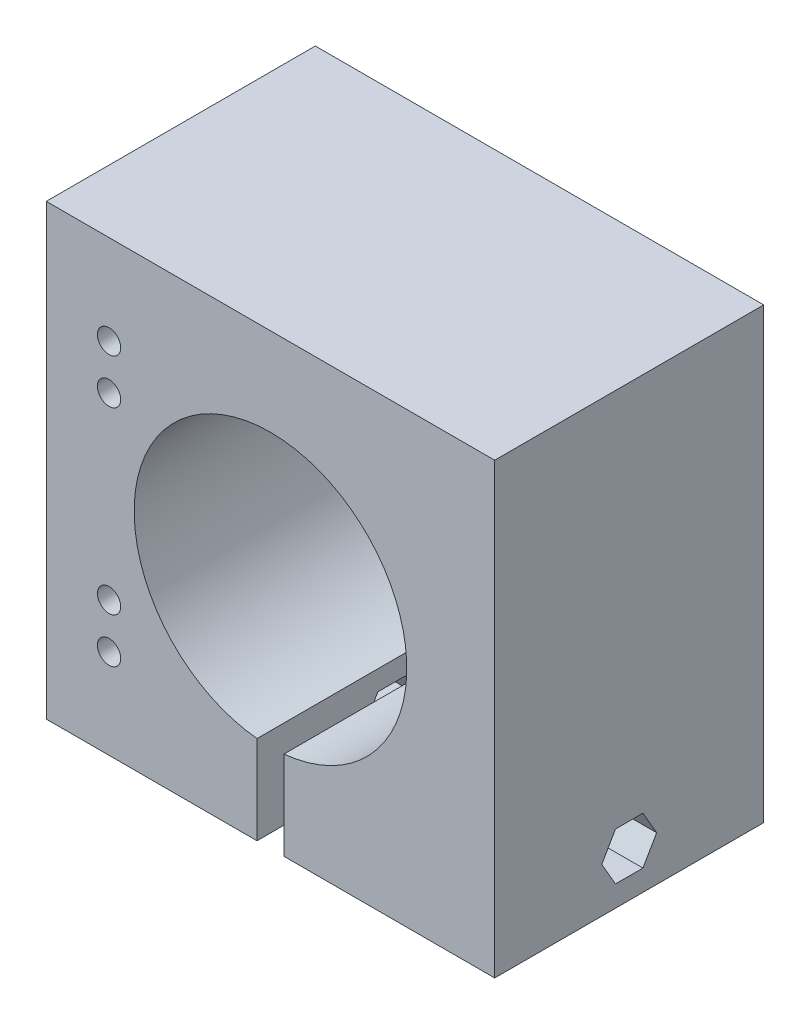
ISO-10303-21;
HEADER;
FILE_DESCRIPTION(('STEP AP214'),'2;1');
FILE_NAME('part.step','',(''),(''),'','','');
FILE_SCHEMA(('AUTOMOTIVE_DESIGN { 1 0 10303 214 1 1 1 1 }'));
ENDSEC;
DATA;
#1=APPLICATION_CONTEXT('core data for automotive mechanical design processes');
#2=APPLICATION_PROTOCOL_DEFINITION('international standard','automotive_design',2000,#1);
#3=PRODUCT_CONTEXT('',#1,'mechanical');
#4=PRODUCT('Part','Part','',(#3));
#5=PRODUCT_RELATED_PRODUCT_CATEGORY('part','',(#4));
#6=PRODUCT_DEFINITION_FORMATION('','',#4);
#7=PRODUCT_DEFINITION_CONTEXT('part definition',#1,'design');
#8=PRODUCT_DEFINITION('design','',#6,#7);
#9=PRODUCT_DEFINITION_SHAPE('','',#8);
#10=(LENGTH_UNIT() NAMED_UNIT(*) SI_UNIT(.MILLI.,.METRE.));
#11=(NAMED_UNIT(*) PLANE_ANGLE_UNIT() SI_UNIT($,.RADIAN.));
#12=(NAMED_UNIT(*) SI_UNIT($,.STERADIAN.) SOLID_ANGLE_UNIT());
#13=UNCERTAINTY_MEASURE_WITH_UNIT(LENGTH_MEASURE(1.E-05),#10,'distance_accuracy_value','');
#14=(GEOMETRIC_REPRESENTATION_CONTEXT(3) GLOBAL_UNCERTAINTY_ASSIGNED_CONTEXT((#13)) GLOBAL_UNIT_ASSIGNED_CONTEXT((#10,
#11,#12)) REPRESENTATION_CONTEXT('',''));
#15=CARTESIAN_POINT('',(0.,0.,0.));
#16=DIRECTION('',(0.,0.,1.));
#17=DIRECTION('',(1.,0.,0.));
#18=AXIS2_PLACEMENT_3D('',#15,#16,#17);
#19=CARTESIAN_POINT('',(-4.,5.,11.940043573295));
#20=DIRECTION('',(0.,0.5,-0.866025403784439));
#21=DIRECTION('',(0.,0.866025403784439,0.5));
#22=AXIS2_PLACEMENT_3D('',#19,#20,#21);
#23=PLANE('',#22);
#24=DIRECTION('',(0.,0.866025403784439,0.5));
#25=VECTOR('',#24,1.);
#26=CARTESIAN_POINT('',(5.,5.,11.940043573295));
#27=LINE('',#26,#25);
#28=CARTESIAN_POINT('',(5.,5.,11.940043573295));
#29=VERTEX_POINT('',#28);
#30=CARTESIAN_POINT('',(5.,7.65,13.4700217866475));
#31=VERTEX_POINT('',#30);
#32=EDGE_CURVE('E265',#29,#31,#27,.T.);
#33=ORIENTED_EDGE('',*,*,#32,.F.);
#34=DIRECTION('',(1.,0.,0.));
#35=VECTOR('',#34,1.);
#36=CARTESIAN_POINT('',(-4.,5.,11.940043573295));
#37=LINE('',#36,#35);
#38=CARTESIAN_POINT('',(23.5,5.,11.940043573295));
#39=VERTEX_POINT('',#38);
#40=EDGE_CURVE('E300',#29,#39,#37,.T.);
#41=ORIENTED_EDGE('',*,*,#40,.T.);
#42=DIRECTION('',(0.,-0.866025403784439,-0.5));
#43=VECTOR('',#42,1.);
#44=CARTESIAN_POINT('',(23.5,-3.92062354108518,6.78971917051014));
#45=LINE('',#44,#43);
#46=CARTESIAN_POINT('',(23.5,7.65,13.4700217866475));
#47=VERTEX_POINT('',#46);
#48=EDGE_CURVE('E406',#47,#39,#45,.T.);
#49=ORIENTED_EDGE('',*,*,#48,.F.);
#50=DIRECTION('',(1.,0.,0.));
#51=VECTOR('',#50,1.);
#52=CARTESIAN_POINT('',(-4.,7.65,13.4700217866475));
#53=LINE('',#52,#51);
#54=EDGE_CURVE('E297',#31,#47,#53,.T.);
#55=ORIENTED_EDGE('',*,*,#54,.F.);
#56=EDGE_LOOP('',(#33,#41,#49,#55));
#57=FACE_BOUND('',#56,.T.);
#58=ADVANCED_FACE('F32',(#57),#23,.F.);
#59=CARTESIAN_POINT('',(-4.,7.65,13.4700217866475));
#60=DIRECTION('',(0.,1.,0.));
#61=DIRECTION('',(0.,0.,1.));
#62=AXIS2_PLACEMENT_3D('',#59,#60,#61);
#63=PLANE('',#62);
#64=DIRECTION('',(0.,0.,1.));
#65=VECTOR('',#64,1.);
#66=CARTESIAN_POINT('',(5.,7.65,13.4700217866475));
#67=LINE('',#66,#65);
#68=CARTESIAN_POINT('',(5.,7.65,16.5299782133525));
#69=VERTEX_POINT('',#68);
#70=EDGE_CURVE('E263',#31,#69,#67,.T.);
#71=ORIENTED_EDGE('',*,*,#70,.F.);
#72=ORIENTED_EDGE('',*,*,#54,.T.);
#73=DIRECTION('',(0.,0.,-1.));
#74=VECTOR('',#73,1.);
#75=CARTESIAN_POINT('',(23.5,7.65,-0.001000000000001));
#76=LINE('',#75,#74);
#77=CARTESIAN_POINT('',(23.5,7.65,16.5299782133525));
#78=VERTEX_POINT('',#77);
#79=EDGE_CURVE('E409',#78,#47,#76,.T.);
#80=ORIENTED_EDGE('',*,*,#79,.F.);
#81=DIRECTION('',(1.,0.,0.));
#82=VECTOR('',#81,1.);
#83=CARTESIAN_POINT('',(-4.,7.65,16.5299782133525));
#84=LINE('',#83,#82);
#85=EDGE_CURVE('E294',#69,#78,#84,.T.);
#86=ORIENTED_EDGE('',*,*,#85,.F.);
#87=EDGE_LOOP('',(#71,#72,#80,#86));
#88=FACE_BOUND('',#87,.T.);
#89=ADVANCED_FACE('F447',(#88),#63,.F.);
#90=CARTESIAN_POINT('',(-4.,7.65,16.5299782133525));
#91=DIRECTION('',(0.,0.5,0.866025403784438));
#92=DIRECTION('',(0.,-0.866025403784438,0.5));
#93=AXIS2_PLACEMENT_3D('',#90,#91,#92);
#94=PLANE('',#93);
#95=DIRECTION('',(0.,-0.866025403784438,0.5));
#96=VECTOR('',#95,1.);
#97=CARTESIAN_POINT('',(5.,7.65,16.5299782133525));
#98=LINE('',#97,#96);
#99=CARTESIAN_POINT('',(5.,5.,18.059956426705));
#100=VERTEX_POINT('',#99);
#101=EDGE_CURVE('E261',#69,#100,#98,.T.);
#102=ORIENTED_EDGE('',*,*,#101,.F.);
#103=ORIENTED_EDGE('',*,*,#85,.T.);
#104=DIRECTION('',(0.,0.866025403784438,-0.5));
#105=VECTOR('',#104,1.);
#106=CARTESIAN_POINT('',(23.5,9.07062354108519,15.7097808294899));
#107=LINE('',#106,#105);
#108=CARTESIAN_POINT('',(23.5,5.,18.059956426705));
#109=VERTEX_POINT('',#108);
#110=EDGE_CURVE('E412',#109,#78,#107,.T.);
#111=ORIENTED_EDGE('',*,*,#110,.F.);
#112=DIRECTION('',(1.,0.,0.));
#113=VECTOR('',#112,1.);
#114=CARTESIAN_POINT('',(-4.,5.,18.059956426705));
#115=LINE('',#114,#113);
#116=EDGE_CURVE('E291',#100,#109,#115,.T.);
#117=ORIENTED_EDGE('',*,*,#116,.F.);
#118=EDGE_LOOP('',(#102,#103,#111,#117));
#119=FACE_BOUND('',#118,.T.);
#120=ADVANCED_FACE('F443',(#119),#94,.F.);
#121=CARTESIAN_POINT('',(-4.,5.,18.059956426705));
#122=DIRECTION('',(0.,-0.499999999999999,0.866025403784439));
#123=DIRECTION('',(0.,-0.866025403784439,-0.499999999999999));
#124=AXIS2_PLACEMENT_3D('',#121,#122,#123);
#125=PLANE('',#124);
#126=DIRECTION('',(0.,-0.866025403784439,-0.499999999999999));
#127=VECTOR('',#126,1.);
#128=CARTESIAN_POINT('',(5.,5.,18.059956426705));
#129=LINE('',#128,#127);
#130=CARTESIAN_POINT('',(5.,2.35,16.5299782133525));
#131=VERTEX_POINT('',#130);
#132=EDGE_CURVE('E259',#100,#131,#129,.T.);
#133=ORIENTED_EDGE('',*,*,#132,.F.);
#134=ORIENTED_EDGE('',*,*,#116,.T.);
#135=DIRECTION('',(0.,0.866025403784439,0.499999999999999));
#136=VECTOR('',#135,1.);
#137=CARTESIAN_POINT('',(23.5,-6.57062354108518,11.3796538105677));
#138=LINE('',#137,#136);
#139=CARTESIAN_POINT('',(23.5,2.35,16.5299782133525));
#140=VERTEX_POINT('',#139);
#141=EDGE_CURVE('E415',#140,#109,#138,.T.);
#142=ORIENTED_EDGE('',*,*,#141,.F.);
#143=DIRECTION('',(1.,0.,0.));
#144=VECTOR('',#143,1.);
#145=CARTESIAN_POINT('',(-4.,2.35,16.5299782133525));
#146=LINE('',#145,#144);
#147=EDGE_CURVE('E288',#131,#140,#146,.T.);
#148=ORIENTED_EDGE('',*,*,#147,.F.);
#149=EDGE_LOOP('',(#133,#134,#142,#148));
#150=FACE_BOUND('',#149,.T.);
#151=ADVANCED_FACE('F437',(#150),#125,.F.);
#152=CARTESIAN_POINT('',(-4.,2.35,16.5299782133525));
#153=DIRECTION('',(0.,-1.,0.));
#154=DIRECTION('',(0.,0.,-1.));
#155=AXIS2_PLACEMENT_3D('',#152,#153,#154);
#156=PLANE('',#155);
#157=DIRECTION('',(0.,0.,-1.));
#158=VECTOR('',#157,1.);
#159=CARTESIAN_POINT('',(5.,2.35,16.5299782133525));
#160=LINE('',#159,#158);
#161=CARTESIAN_POINT('',(5.,2.35,13.4700217866475));
#162=VERTEX_POINT('',#161);
#163=EDGE_CURVE('E54',#131,#162,#160,.T.);
#164=ORIENTED_EDGE('',*,*,#163,.F.);
#165=ORIENTED_EDGE('',*,*,#147,.T.);
#166=DIRECTION('',(0.,0.,1.));
#167=VECTOR('',#166,1.);
#168=CARTESIAN_POINT('',(23.5,2.35,-0.001000000000001));
#169=LINE('',#168,#167);
#170=CARTESIAN_POINT('',(23.5,2.35,13.4700217866475));
#171=VERTEX_POINT('',#170);
#172=EDGE_CURVE('E418',#171,#140,#169,.T.);
#173=ORIENTED_EDGE('',*,*,#172,.F.);
#174=DIRECTION('',(1.,0.,0.));
#175=VECTOR('',#174,1.);
#176=CARTESIAN_POINT('',(-4.,2.35,13.4700217866475));
#177=LINE('',#176,#175);
#178=EDGE_CURVE('E287',#162,#171,#177,.T.);
#179=ORIENTED_EDGE('',*,*,#178,.F.);
#180=EDGE_LOOP('',(#164,#165,#173,#179));
#181=FACE_BOUND('',#180,.T.);
#182=ADVANCED_FACE('F432',(#181),#156,.F.);
#183=CARTESIAN_POINT('',(-4.,2.35,13.4700217866475));
#184=DIRECTION('',(0.,-0.500000000000001,-0.866025403784438));
#185=DIRECTION('',(0.,0.866025403784438,-0.500000000000001));
#186=AXIS2_PLACEMENT_3D('',#183,#184,#185);
#187=PLANE('',#186);
#188=DIRECTION('',(0.,0.866025403784438,-0.500000000000001));
#189=VECTOR('',#188,1.);
#190=CARTESIAN_POINT('',(5.,2.35,13.4700217866475));
#191=LINE('',#190,#189);
#192=EDGE_CURVE('E11',#162,#29,#191,.T.);
#193=ORIENTED_EDGE('',*,*,#192,.F.);
#194=ORIENTED_EDGE('',*,*,#178,.T.);
#195=DIRECTION('',(0.,-0.866025403784438,0.500000000000001));
#196=VECTOR('',#195,1.);
#197=CARTESIAN_POINT('',(23.5,6.42062354108519,11.1198461894323));
#198=LINE('',#197,#196);
#199=EDGE_CURVE('E40',#39,#171,#198,.T.);
#200=ORIENTED_EDGE('',*,*,#199,.F.);
#201=ORIENTED_EDGE('',*,*,#40,.F.);
#202=EDGE_LOOP('',(#193,#194,#200,#201));
#203=FACE_BOUND('',#202,.T.);
#204=ADVANCED_FACE('F429',(#203),#187,.F.);
#205=CARTESIAN_POINT('',(0.,0.,30.));
#206=DIRECTION('',(0.,1.,0.));
#207=DIRECTION('',(0.,0.,1.));
#208=AXIS2_PLACEMENT_3D('',#205,#206,#207);
#209=PLANE('',#208);
#210=DIRECTION('',(1.,0.,0.));
#211=VECTOR('',#210,1.);
#212=CARTESIAN_POINT('',(0.,0.,0.));
#213=LINE('',#212,#211);
#214=CARTESIAN_POINT('',(0.,0.,0.));
#215=VERTEX_POINT('',#214);
#216=CARTESIAN_POINT('',(23.5,0.,0.));
#217=VERTEX_POINT('',#216);
#218=EDGE_CURVE('E389',#215,#217,#213,.T.);
#219=ORIENTED_EDGE('',*,*,#218,.T.);
#220=DIRECTION('',(0.,0.,1.));
#221=VECTOR('',#220,1.);
#222=CARTESIAN_POINT('',(23.5,0.,-0.001000000000001));
#223=LINE('',#222,#221);
#224=CARTESIAN_POINT('',(23.5,0.,30.));
#225=VERTEX_POINT('',#224);
#226=EDGE_CURVE('E337',#217,#225,#223,.T.);
#227=ORIENTED_EDGE('',*,*,#226,.T.);
#228=DIRECTION('',(1.,0.,0.));
#229=VECTOR('',#228,1.);
#230=CARTESIAN_POINT('',(0.,0.,30.));
#231=LINE('',#230,#229);
#232=CARTESIAN_POINT('',(0.,0.,30.));
#233=VERTEX_POINT('',#232);
#234=EDGE_CURVE('E378',#233,#225,#231,.T.);
#235=ORIENTED_EDGE('',*,*,#234,.F.);
#236=DIRECTION('',(0.,0.,-1.));
#237=VECTOR('',#236,1.);
#238=CARTESIAN_POINT('',(0.,0.,30.));
#239=LINE('',#238,#237);
#240=EDGE_CURVE('E403',#233,#215,#239,.T.);
#241=ORIENTED_EDGE('',*,*,#240,.T.);
#242=EDGE_LOOP('',(#219,#227,#235,#241));
#243=FACE_BOUND('',#242,.T.);
#244=ADVANCED_FACE('F473',(#243),#209,.F.);
#245=CARTESIAN_POINT('',(0.,0.,30.));
#246=DIRECTION('',(0.,0.,-1.));
#247=DIRECTION('',(-1.,0.,0.));
#248=AXIS2_PLACEMENT_3D('',#245,#246,#247);
#249=PLANE('',#248);
#250=CARTESIAN_POINT('',(7.,10.,30.));
#251=DIRECTION('',(0.,0.,1.));
#252=DIRECTION('',(1.,0.,0.));
#253=AXIS2_PLACEMENT_3D('',#250,#251,#252);
#254=CIRCLE('',#253,1.3);
#255=CARTESIAN_POINT('',(8.30000000000001,10.,30.));
#256=VERTEX_POINT('',#255);
#257=EDGE_CURVE('E349',#256,#256,#254,.T.);
#258=ORIENTED_EDGE('',*,*,#257,.F.);
#259=EDGE_LOOP('',(#258));
#260=FACE_BOUND('',#259,.T.);
#261=CARTESIAN_POINT('',(7.,15.,30.));
#262=DIRECTION('',(0.,0.,1.));
#263=DIRECTION('',(1.,0.,0.));
#264=AXIS2_PLACEMENT_3D('',#261,#262,#263);
#265=CIRCLE('',#264,1.3);
#266=CARTESIAN_POINT('',(8.30000000000001,15.,30.));
#267=VERTEX_POINT('',#266);
#268=EDGE_CURVE('E361',#267,#267,#265,.T.);
#269=ORIENTED_EDGE('',*,*,#268,.F.);
#270=EDGE_LOOP('',(#269));
#271=FACE_BOUND('',#270,.T.);
#272=ORIENTED_EDGE('',*,*,#234,.T.);
#273=DIRECTION('',(0.,-1.,0.));
#274=VECTOR('',#273,1.);
#275=CARTESIAN_POINT('',(23.5,0.,30.));
#276=LINE('',#275,#274);
#277=CARTESIAN_POINT('',(23.5,9.87419423633901,30.));
#278=VERTEX_POINT('',#277);
#279=EDGE_CURVE('E333',#278,#225,#276,.T.);
#280=ORIENTED_EDGE('',*,*,#279,.F.);
#281=CARTESIAN_POINT('',(25.,25.,30.));
#282=DIRECTION('',(0.,0.,1.));
#283=DIRECTION('',(1.,0.,0.));
#284=AXIS2_PLACEMENT_3D('',#281,#282,#283);
#285=CIRCLE('',#284,15.2);
#286=CARTESIAN_POINT('',(26.5,9.87419423633901,30.));
#287=VERTEX_POINT('',#286);
#288=EDGE_CURVE('E367',#287,#278,#285,.T.);
#289=ORIENTED_EDGE('',*,*,#288,.F.);
#290=DIRECTION('',(0.,1.,0.));
#291=VECTOR('',#290,1.);
#292=CARTESIAN_POINT('',(26.5,0.,30.));
#293=LINE('',#292,#291);
#294=CARTESIAN_POINT('',(26.5,0.,30.));
#295=VERTEX_POINT('',#294);
#296=EDGE_CURVE('E335',#295,#287,#293,.T.);
#297=ORIENTED_EDGE('',*,*,#296,.F.);
#298=CARTESIAN_POINT('',(50.,0.,30.));
#299=VERTEX_POINT('',#298);
#300=EDGE_CURVE('E376',#295,#299,#231,.T.);
#301=ORIENTED_EDGE('',*,*,#300,.T.);
#302=DIRECTION('',(0.,1.,0.));
#303=VECTOR('',#302,1.);
#304=CARTESIAN_POINT('',(50.,0.,30.));
#305=LINE('',#304,#303);
#306=CARTESIAN_POINT('',(50.,50.,30.));
#307=VERTEX_POINT('',#306);
#308=EDGE_CURVE('E381',#299,#307,#305,.T.);
#309=ORIENTED_EDGE('',*,*,#308,.T.);
#310=DIRECTION('',(-1.,0.,0.));
#311=VECTOR('',#310,1.);
#312=CARTESIAN_POINT('',(0.,50.,30.));
#313=LINE('',#312,#311);
#314=CARTESIAN_POINT('',(0.,50.,30.));
#315=VERTEX_POINT('',#314);
#316=EDGE_CURVE('E383',#307,#315,#313,.T.);
#317=ORIENTED_EDGE('',*,*,#316,.T.);
#318=DIRECTION('',(0.,-1.,0.));
#319=VECTOR('',#318,1.);
#320=CARTESIAN_POINT('',(0.,0.,30.));
#321=LINE('',#320,#319);
#322=EDGE_CURVE('E373',#315,#233,#321,.T.);
#323=ORIENTED_EDGE('',*,*,#322,.T.);
#324=EDGE_LOOP('',(#272,#280,#289,#297,#301,#309,#317,#323));
#325=FACE_BOUND('',#324,.T.);
#326=CARTESIAN_POINT('',(7.00000000000001,40.,30.));
#327=DIRECTION('',(0.,0.,1.));
#328=DIRECTION('',(1.,0.,0.));
#329=AXIS2_PLACEMENT_3D('',#326,#327,#328);
#330=CIRCLE('',#329,1.3);
#331=CARTESIAN_POINT('',(8.30000000000001,40.,30.));
#332=VERTEX_POINT('',#331);
#333=EDGE_CURVE('E355',#332,#332,#330,.T.);
#334=ORIENTED_EDGE('',*,*,#333,.F.);
#335=EDGE_LOOP('',(#334));
#336=FACE_BOUND('',#335,.T.);
#337=CARTESIAN_POINT('',(7.,35.,30.));
#338=DIRECTION('',(0.,0.,1.));
#339=DIRECTION('',(1.,0.,0.));
#340=AXIS2_PLACEMENT_3D('',#337,#338,#339);
#341=CIRCLE('',#340,1.3);
#342=CARTESIAN_POINT('',(8.3,35.,30.));
#343=VERTEX_POINT('',#342);
#344=EDGE_CURVE('E343',#343,#343,#341,.T.);
#345=ORIENTED_EDGE('',*,*,#344,.F.);
#346=EDGE_LOOP('',(#345));
#347=FACE_BOUND('',#346,.T.);
#348=ADVANCED_FACE('F502',(#260,#271,#325,#336,#347),#249,.F.);
#349=CARTESIAN_POINT('',(0.,0.,0.));
#350=DIRECTION('',(0.,0.,-1.));
#351=DIRECTION('',(-1.,0.,0.));
#352=AXIS2_PLACEMENT_3D('',#349,#350,#351);
#353=PLANE('',#352);
#354=DIRECTION('',(0.,-1.,0.));
#355=VECTOR('',#354,1.);
#356=CARTESIAN_POINT('',(23.5,0.,0.));
#357=LINE('',#356,#355);
#358=CARTESIAN_POINT('',(23.5,9.87419423633901,0.));
#359=VERTEX_POINT('',#358);
#360=EDGE_CURVE('E330',#359,#217,#357,.T.);
#361=ORIENTED_EDGE('',*,*,#360,.T.);
#362=ORIENTED_EDGE('',*,*,#218,.F.);
#363=DIRECTION('',(0.,-1.,0.));
#364=VECTOR('',#363,1.);
#365=CARTESIAN_POINT('',(0.,0.,0.));
#366=LINE('',#365,#364);
#367=CARTESIAN_POINT('',(0.,50.,0.));
#368=VERTEX_POINT('',#367);
#369=EDGE_CURVE('E370',#368,#215,#366,.T.);
#370=ORIENTED_EDGE('',*,*,#369,.F.);
#371=DIRECTION('',(-1.,0.,0.));
#372=VECTOR('',#371,1.);
#373=CARTESIAN_POINT('',(0.,50.,0.));
#374=LINE('',#373,#372);
#375=CARTESIAN_POINT('',(50.,50.,0.));
#376=VERTEX_POINT('',#375);
#377=EDGE_CURVE('E377',#376,#368,#374,.T.);
#378=ORIENTED_EDGE('',*,*,#377,.F.);
#379=DIRECTION('',(0.,1.,0.));
#380=VECTOR('',#379,1.);
#381=CARTESIAN_POINT('',(50.,0.,0.));
#382=LINE('',#381,#380);
#383=CARTESIAN_POINT('',(50.,0.,0.));
#384=VERTEX_POINT('',#383);
#385=EDGE_CURVE('E392',#384,#376,#382,.T.);
#386=ORIENTED_EDGE('',*,*,#385,.F.);
#387=CARTESIAN_POINT('',(26.5,0.,0.));
#388=VERTEX_POINT('',#387);
#389=EDGE_CURVE('E388',#388,#384,#213,.T.);
#390=ORIENTED_EDGE('',*,*,#389,.F.);
#391=DIRECTION('',(0.,1.,0.));
#392=VECTOR('',#391,1.);
#393=CARTESIAN_POINT('',(26.5,0.,0.));
#394=LINE('',#393,#392);
#395=CARTESIAN_POINT('',(26.5,9.87419423633901,0.));
#396=VERTEX_POINT('',#395);
#397=EDGE_CURVE('E327',#388,#396,#394,.T.);
#398=ORIENTED_EDGE('',*,*,#397,.T.);
#399=CARTESIAN_POINT('',(25.,25.,0.));
#400=DIRECTION('',(0.,0.,1.));
#401=DIRECTION('',(1.,0.,0.));
#402=AXIS2_PLACEMENT_3D('',#399,#400,#401);
#403=CIRCLE('',#402,15.2);
#404=EDGE_CURVE('E364',#396,#359,#403,.T.);
#405=ORIENTED_EDGE('',*,*,#404,.T.);
#406=EDGE_LOOP('',(#361,#362,#370,#378,#386,#390,#398,#405));
#407=FACE_BOUND('',#406,.T.);
#408=CARTESIAN_POINT('',(7.,10.,0.));
#409=DIRECTION('',(0.,0.,1.));
#410=DIRECTION('',(1.,0.,0.));
#411=AXIS2_PLACEMENT_3D('',#408,#409,#410);
#412=CIRCLE('',#411,1.3);
#413=CARTESIAN_POINT('',(8.30000000000001,10.,0.));
#414=VERTEX_POINT('',#413);
#415=EDGE_CURVE('E346',#414,#414,#412,.T.);
#416=ORIENTED_EDGE('',*,*,#415,.T.);
#417=EDGE_LOOP('',(#416));
#418=FACE_BOUND('',#417,.T.);
#419=CARTESIAN_POINT('',(7.,15.,0.));
#420=DIRECTION('',(0.,0.,1.));
#421=DIRECTION('',(1.,0.,0.));
#422=AXIS2_PLACEMENT_3D('',#419,#420,#421);
#423=CIRCLE('',#422,1.3);
#424=CARTESIAN_POINT('',(8.30000000000001,15.,0.));
#425=VERTEX_POINT('',#424);
#426=EDGE_CURVE('E358',#425,#425,#423,.T.);
#427=ORIENTED_EDGE('',*,*,#426,.T.);
#428=EDGE_LOOP('',(#427));
#429=FACE_BOUND('',#428,.T.);
#430=CARTESIAN_POINT('',(7.00000000000001,40.,0.));
#431=DIRECTION('',(0.,0.,1.));
#432=DIRECTION('',(1.,0.,0.));
#433=AXIS2_PLACEMENT_3D('',#430,#431,#432);
#434=CIRCLE('',#433,1.3);
#435=CARTESIAN_POINT('',(8.30000000000001,40.,0.));
#436=VERTEX_POINT('',#435);
#437=EDGE_CURVE('E352',#436,#436,#434,.T.);
#438=ORIENTED_EDGE('',*,*,#437,.T.);
#439=EDGE_LOOP('',(#438));
#440=FACE_BOUND('',#439,.T.);
#441=CARTESIAN_POINT('',(7.,35.,0.));
#442=DIRECTION('',(0.,0.,1.));
#443=DIRECTION('',(1.,0.,0.));
#444=AXIS2_PLACEMENT_3D('',#441,#442,#443);
#445=CIRCLE('',#444,1.3);
#446=CARTESIAN_POINT('',(8.3,35.,0.));
#447=VERTEX_POINT('',#446);
#448=EDGE_CURVE('E340',#447,#447,#445,.T.);
#449=ORIENTED_EDGE('',*,*,#448,.T.);
#450=EDGE_LOOP('',(#449));
#451=FACE_BOUND('',#450,.T.);
#452=ADVANCED_FACE('F505',(#407,#418,#429,#440,#451),#353,.T.);
#453=CARTESIAN_POINT('',(0.,0.,30.));
#454=DIRECTION('',(1.,0.,0.));
#455=DIRECTION('',(0.,0.,-1.));
#456=AXIS2_PLACEMENT_3D('',#453,#454,#455);
#457=PLANE('',#456);
#458=DIRECTION('',(0.,0.866025403784439,-0.5));
#459=VECTOR('',#458,1.);
#460=CARTESIAN_POINT('',(0.,5.,19.7920072342739));
#461=LINE('',#460,#459);
#462=CARTESIAN_POINT('',(0.,5.,19.7920072342739));
#463=VERTEX_POINT('',#462);
#464=CARTESIAN_POINT('',(0.,9.15,17.3960036171369));
#465=VERTEX_POINT('',#464);
#466=EDGE_CURVE('E239',#463,#465,#461,.T.);
#467=ORIENTED_EDGE('',*,*,#466,.F.);
#468=DIRECTION('',(0.,0.866025403784438,0.5));
#469=VECTOR('',#468,1.);
#470=CARTESIAN_POINT('',(0.,0.850000000000003,17.3960036171369));
#471=LINE('',#470,#469);
#472=CARTESIAN_POINT('',(0.,0.850000000000003,17.3960036171369));
#473=VERTEX_POINT('',#472);
#474=EDGE_CURVE('E47',#473,#463,#471,.T.);
#475=ORIENTED_EDGE('',*,*,#474,.F.);
#476=DIRECTION('',(0.,0.,1.));
#477=VECTOR('',#476,1.);
#478=CARTESIAN_POINT('',(0.,0.850000000000003,12.6039963828631));
#479=LINE('',#478,#477);
#480=CARTESIAN_POINT('',(0.,0.850000000000003,12.6039963828631));
#481=VERTEX_POINT('',#480);
#482=EDGE_CURVE('E225',#481,#473,#479,.T.);
#483=ORIENTED_EDGE('',*,*,#482,.F.);
#484=DIRECTION('',(0.,-0.866025403784439,0.5));
#485=VECTOR('',#484,1.);
#486=CARTESIAN_POINT('',(0.,5.,10.2079927657261));
#487=LINE('',#486,#485);
#488=CARTESIAN_POINT('',(0.,5.,10.2079927657261));
#489=VERTEX_POINT('',#488);
#490=EDGE_CURVE('E228',#489,#481,#487,.T.);
#491=ORIENTED_EDGE('',*,*,#490,.F.);
#492=DIRECTION('',(0.,-0.866025403784439,-0.5));
#493=VECTOR('',#492,1.);
#494=CARTESIAN_POINT('',(0.,9.15,12.6039963828631));
#495=LINE('',#494,#493);
#496=CARTESIAN_POINT('',(0.,9.15,12.6039963828631));
#497=VERTEX_POINT('',#496);
#498=EDGE_CURVE('E244',#497,#489,#495,.T.);
#499=ORIENTED_EDGE('',*,*,#498,.F.);
#500=DIRECTION('',(0.,0.,-1.));
#501=VECTOR('',#500,1.);
#502=CARTESIAN_POINT('',(0.,9.15,17.3960036171369));
#503=LINE('',#502,#501);
#504=EDGE_CURVE('E241',#465,#497,#503,.T.);
#505=ORIENTED_EDGE('',*,*,#504,.F.);
#506=EDGE_LOOP('',(#467,#475,#483,#491,#499,#505));
#507=FACE_BOUND('',#506,.T.);
#508=ORIENTED_EDGE('',*,*,#369,.T.);
#509=ORIENTED_EDGE('',*,*,#240,.F.);
#510=ORIENTED_EDGE('',*,*,#322,.F.);
#511=DIRECTION('',(0.,0.,-1.));
#512=VECTOR('',#511,1.);
#513=CARTESIAN_POINT('',(0.,50.,30.));
#514=LINE('',#513,#512);
#515=EDGE_CURVE('E385',#315,#368,#514,.T.);
#516=ORIENTED_EDGE('',*,*,#515,.T.);
#517=EDGE_LOOP('',(#508,#509,#510,#516));
#518=FACE_BOUND('',#517,.T.);
#519=ADVANCED_FACE('F34',(#507,#518),#457,.F.);
#520=ORIENTED_EDGE('',*,*,#300,.F.);
#521=DIRECTION('',(0.,0.,1.));
#522=VECTOR('',#521,1.);
#523=CARTESIAN_POINT('',(26.5,0.,-0.001000000000001));
#524=LINE('',#523,#522);
#525=EDGE_CURVE('E338',#388,#295,#524,.T.);
#526=ORIENTED_EDGE('',*,*,#525,.F.);
#527=ORIENTED_EDGE('',*,*,#389,.T.);
#528=DIRECTION('',(0.,0.,-1.));
#529=VECTOR('',#528,1.);
#530=CARTESIAN_POINT('',(50.,0.,30.));
#531=LINE('',#530,#529);
#532=EDGE_CURVE('E400',#299,#384,#531,.T.);
#533=ORIENTED_EDGE('',*,*,#532,.F.);
#534=EDGE_LOOP('',(#520,#526,#527,#533));
#535=FACE_BOUND('',#534,.T.);
#536=ADVANCED_FACE('F515',(#535),#209,.F.);
#537=CARTESIAN_POINT('',(50.,0.,30.));
#538=DIRECTION('',(-1.,0.,0.));
#539=DIRECTION('',(0.,0.,1.));
#540=AXIS2_PLACEMENT_3D('',#537,#538,#539);
#541=PLANE('',#540);
#542=DIRECTION('',(0.,0.866025403784439,0.5));
#543=VECTOR('',#542,1.);
#544=CARTESIAN_POINT('',(50.,5.,11.940043573295));
#545=LINE('',#544,#543);
#546=CARTESIAN_POINT('',(50.,5.,11.940043573295));
#547=VERTEX_POINT('',#546);
#548=CARTESIAN_POINT('',(50.,7.65,13.4700217866475));
#549=VERTEX_POINT('',#548);
#550=EDGE_CURVE('E269',#547,#549,#545,.T.);
#551=ORIENTED_EDGE('',*,*,#550,.F.);
#552=DIRECTION('',(0.,0.866025403784438,-0.500000000000001));
#553=VECTOR('',#552,1.);
#554=CARTESIAN_POINT('',(50.,2.35,13.4700217866475));
#555=LINE('',#554,#553);
#556=CARTESIAN_POINT('',(50.,2.35,13.4700217866475));
#557=VERTEX_POINT('',#556);
#558=EDGE_CURVE('E267',#557,#547,#555,.T.);
#559=ORIENTED_EDGE('',*,*,#558,.F.);
#560=DIRECTION('',(0.,0.,-1.));
#561=VECTOR('',#560,1.);
#562=CARTESIAN_POINT('',(50.,2.35,16.5299782133525));
#563=LINE('',#562,#561);
#564=CARTESIAN_POINT('',(50.,2.35,16.5299782133525));
#565=VERTEX_POINT('',#564);
#566=EDGE_CURVE('E281',#565,#557,#563,.T.);
#567=ORIENTED_EDGE('',*,*,#566,.F.);
#568=DIRECTION('',(0.,-0.866025403784439,-0.499999999999999));
#569=VECTOR('',#568,1.);
#570=CARTESIAN_POINT('',(50.,5.,18.059956426705));
#571=LINE('',#570,#569);
#572=CARTESIAN_POINT('',(50.,5.,18.059956426705));
#573=VERTEX_POINT('',#572);
#574=EDGE_CURVE('E278',#573,#565,#571,.T.);
#575=ORIENTED_EDGE('',*,*,#574,.F.);
#576=DIRECTION('',(0.,-0.866025403784438,0.5));
#577=VECTOR('',#576,1.);
#578=CARTESIAN_POINT('',(50.,7.65,16.5299782133525));
#579=LINE('',#578,#577);
#580=CARTESIAN_POINT('',(50.,7.65,16.5299782133525));
#581=VERTEX_POINT('',#580);
#582=EDGE_CURVE('E275',#581,#573,#579,.T.);
#583=ORIENTED_EDGE('',*,*,#582,.F.);
#584=DIRECTION('',(0.,0.,1.));
#585=VECTOR('',#584,1.);
#586=CARTESIAN_POINT('',(50.,7.65,13.4700217866475));
#587=LINE('',#586,#585);
#588=EDGE_CURVE('E272',#549,#581,#587,.T.);
#589=ORIENTED_EDGE('',*,*,#588,.F.);
#590=EDGE_LOOP('',(#551,#559,#567,#575,#583,#589));
#591=FACE_BOUND('',#590,.T.);
#592=ORIENTED_EDGE('',*,*,#385,.T.);
#593=DIRECTION('',(0.,0.,-1.));
#594=VECTOR('',#593,1.);
#595=CARTESIAN_POINT('',(50.,50.,30.));
#596=LINE('',#595,#594);
#597=EDGE_CURVE('E397',#307,#376,#596,.T.);
#598=ORIENTED_EDGE('',*,*,#597,.F.);
#599=ORIENTED_EDGE('',*,*,#308,.F.);
#600=ORIENTED_EDGE('',*,*,#532,.T.);
#601=EDGE_LOOP('',(#592,#598,#599,#600));
#602=FACE_BOUND('',#601,.T.);
#603=ADVANCED_FACE('F512',(#591,#602),#541,.F.);
#604=CARTESIAN_POINT('',(0.,50.,30.));
#605=DIRECTION('',(0.,-1.,0.));
#606=DIRECTION('',(0.,0.,-1.));
#607=AXIS2_PLACEMENT_3D('',#604,#605,#606);
#608=PLANE('',#607);
#609=ORIENTED_EDGE('',*,*,#377,.T.);
#610=ORIENTED_EDGE('',*,*,#515,.F.);
#611=ORIENTED_EDGE('',*,*,#316,.F.);
#612=ORIENTED_EDGE('',*,*,#597,.T.);
#613=EDGE_LOOP('',(#609,#610,#611,#612));
#614=FACE_BOUND('',#613,.T.);
#615=ADVANCED_FACE('F500',(#614),#608,.F.);
#616=CARTESIAN_POINT('',(25.,25.,30.));
#617=DIRECTION('',(0.,0.,-1.));
#618=DIRECTION('',(-1.,0.,0.));
#619=AXIS2_PLACEMENT_3D('',#616,#617,#618);
#620=CYLINDRICAL_SURFACE('',#619,15.2);
#621=DIRECTION('',(0.,0.,-1.));
#622=VECTOR('',#621,1.);
#623=CARTESIAN_POINT('',(23.5,9.87419423633901,30.));
#624=LINE('',#623,#622);
#625=EDGE_CURVE('E324',#278,#359,#624,.T.);
#626=ORIENTED_EDGE('',*,*,#625,.T.);
#627=ORIENTED_EDGE('',*,*,#404,.F.);
#628=DIRECTION('',(0.,0.,-1.));
#629=VECTOR('',#628,1.);
#630=CARTESIAN_POINT('',(26.5,9.87419423633901,30.));
#631=LINE('',#630,#629);
#632=EDGE_CURVE('E321',#396,#287,#631,.F.);
#633=ORIENTED_EDGE('',*,*,#632,.T.);
#634=ORIENTED_EDGE('',*,*,#288,.T.);
#635=EDGE_LOOP('',(#626,#627,#633,#634));
#636=FACE_BOUND('',#635,.T.);
#637=ADVANCED_FACE('F496',(#636),#620,.F.);
#638=CARTESIAN_POINT('',(7.,15.,30.));
#639=DIRECTION('',(0.,0.,-1.));
#640=DIRECTION('',(-1.,0.,0.));
#641=AXIS2_PLACEMENT_3D('',#638,#639,#640);
#642=CYLINDRICAL_SURFACE('',#641,1.3);
#643=ORIENTED_EDGE('',*,*,#268,.T.);
#644=EDGE_LOOP('',(#643));
#645=FACE_BOUND('',#644,.T.);
#646=ORIENTED_EDGE('',*,*,#426,.F.);
#647=EDGE_LOOP('',(#646));
#648=FACE_BOUND('',#647,.T.);
#649=ADVANCED_FACE('F492',(#645,#648),#642,.F.);
#650=CARTESIAN_POINT('',(7.00000000000001,40.,30.));
#651=DIRECTION('',(0.,0.,-1.));
#652=DIRECTION('',(-1.,0.,0.));
#653=AXIS2_PLACEMENT_3D('',#650,#651,#652);
#654=CYLINDRICAL_SURFACE('',#653,1.3);
#655=ORIENTED_EDGE('',*,*,#333,.T.);
#656=EDGE_LOOP('',(#655));
#657=FACE_BOUND('',#656,.T.);
#658=ORIENTED_EDGE('',*,*,#437,.F.);
#659=EDGE_LOOP('',(#658));
#660=FACE_BOUND('',#659,.T.);
#661=ADVANCED_FACE('F488',(#657,#660),#654,.F.);
#662=CARTESIAN_POINT('',(7.,10.,30.));
#663=DIRECTION('',(0.,0.,-1.));
#664=DIRECTION('',(-1.,0.,0.));
#665=AXIS2_PLACEMENT_3D('',#662,#663,#664);
#666=CYLINDRICAL_SURFACE('',#665,1.3);
#667=ORIENTED_EDGE('',*,*,#257,.T.);
#668=EDGE_LOOP('',(#667));
#669=FACE_BOUND('',#668,.T.);
#670=ORIENTED_EDGE('',*,*,#415,.F.);
#671=EDGE_LOOP('',(#670));
#672=FACE_BOUND('',#671,.T.);
#673=ADVANCED_FACE('F484',(#669,#672),#666,.F.);
#674=CARTESIAN_POINT('',(7.,35.,30.));
#675=DIRECTION('',(0.,0.,-1.));
#676=DIRECTION('',(-1.,0.,0.));
#677=AXIS2_PLACEMENT_3D('',#674,#675,#676);
#678=CYLINDRICAL_SURFACE('',#677,1.3);
#679=ORIENTED_EDGE('',*,*,#344,.T.);
#680=EDGE_LOOP('',(#679));
#681=FACE_BOUND('',#680,.T.);
#682=ORIENTED_EDGE('',*,*,#448,.F.);
#683=EDGE_LOOP('',(#682));
#684=FACE_BOUND('',#683,.T.);
#685=ADVANCED_FACE('F478',(#681,#684),#678,.F.);
#686=CARTESIAN_POINT('',(26.5,0.,-0.001000000000001));
#687=DIRECTION('',(1.,0.,0.));
#688=DIRECTION('',(0.,0.,-1.));
#689=AXIS2_PLACEMENT_3D('',#686,#687,#688);
#690=PLANE('',#689);
#691=DIRECTION('',(0.,0.,-1.));
#692=VECTOR('',#691,1.);
#693=CARTESIAN_POINT('',(26.5,2.35,-0.001000000000001));
#694=LINE('',#693,#692);
#695=CARTESIAN_POINT('',(26.5,2.35,16.5299782133525));
#696=VERTEX_POINT('',#695);
#697=CARTESIAN_POINT('',(26.5,2.35,13.4700217866475));
#698=VERTEX_POINT('',#697);
#699=EDGE_CURVE('E315',#696,#698,#694,.T.);
#700=ORIENTED_EDGE('',*,*,#699,.T.);
#701=DIRECTION('',(0.,0.866025403784438,-0.500000000000001));
#702=VECTOR('',#701,1.);
#703=CARTESIAN_POINT('',(26.5,6.42062354108519,11.1198461894323));
#704=LINE('',#703,#702);
#705=CARTESIAN_POINT('',(26.5,5.,11.940043573295));
#706=VERTEX_POINT('',#705);
#707=EDGE_CURVE('E318',#698,#706,#704,.T.);
#708=ORIENTED_EDGE('',*,*,#707,.T.);
#709=DIRECTION('',(0.,0.866025403784439,0.5));
#710=VECTOR('',#709,1.);
#711=CARTESIAN_POINT('',(26.5,-3.92062354108518,6.78971917051014));
#712=LINE('',#711,#710);
#713=CARTESIAN_POINT('',(26.5,7.65,13.4700217866475));
#714=VERTEX_POINT('',#713);
#715=EDGE_CURVE('E303',#706,#714,#712,.T.);
#716=ORIENTED_EDGE('',*,*,#715,.T.);
#717=DIRECTION('',(0.,0.,1.));
#718=VECTOR('',#717,1.);
#719=CARTESIAN_POINT('',(26.5,7.65,-0.001000000000001));
#720=LINE('',#719,#718);
#721=CARTESIAN_POINT('',(26.5,7.65,16.5299782133525));
#722=VERTEX_POINT('',#721);
#723=EDGE_CURVE('E306',#714,#722,#720,.T.);
#724=ORIENTED_EDGE('',*,*,#723,.T.);
#725=DIRECTION('',(0.,-0.866025403784438,0.5));
#726=VECTOR('',#725,1.);
#727=CARTESIAN_POINT('',(26.5,9.07062354108519,15.7097808294899));
#728=LINE('',#727,#726);
#729=CARTESIAN_POINT('',(26.5,5.,18.059956426705));
#730=VERTEX_POINT('',#729);
#731=EDGE_CURVE('E309',#722,#730,#728,.T.);
#732=ORIENTED_EDGE('',*,*,#731,.T.);
#733=DIRECTION('',(0.,-0.866025403784439,-0.499999999999999));
#734=VECTOR('',#733,1.);
#735=CARTESIAN_POINT('',(26.5,-6.57062354108518,11.3796538105677));
#736=LINE('',#735,#734);
#737=EDGE_CURVE('E312',#730,#696,#736,.T.);
#738=ORIENTED_EDGE('',*,*,#737,.T.);
#739=EDGE_LOOP('',(#700,#708,#716,#724,#732,#738));
#740=FACE_BOUND('',#739,.T.);
#741=ORIENTED_EDGE('',*,*,#525,.T.);
#742=ORIENTED_EDGE('',*,*,#296,.T.);
#743=ORIENTED_EDGE('',*,*,#632,.F.);
#744=ORIENTED_EDGE('',*,*,#397,.F.);
#745=EDGE_LOOP('',(#741,#742,#743,#744));
#746=FACE_BOUND('',#745,.T.);
#747=ADVANCED_FACE('F475',(#740,#746),#690,.F.);
#748=CARTESIAN_POINT('',(23.5,0.,-0.001000000000001));
#749=DIRECTION('',(-1.,0.,0.));
#750=DIRECTION('',(0.,0.,1.));
#751=AXIS2_PLACEMENT_3D('',#748,#749,#750);
#752=PLANE('',#751);
#753=ORIENTED_EDGE('',*,*,#48,.T.);
#754=ORIENTED_EDGE('',*,*,#199,.T.);
#755=ORIENTED_EDGE('',*,*,#172,.T.);
#756=ORIENTED_EDGE('',*,*,#141,.T.);
#757=ORIENTED_EDGE('',*,*,#110,.T.);
#758=ORIENTED_EDGE('',*,*,#79,.T.);
#759=EDGE_LOOP('',(#753,#754,#755,#756,#757,#758));
#760=FACE_BOUND('',#759,.T.);
#761=ORIENTED_EDGE('',*,*,#625,.F.);
#762=ORIENTED_EDGE('',*,*,#279,.T.);
#763=ORIENTED_EDGE('',*,*,#226,.F.);
#764=ORIENTED_EDGE('',*,*,#360,.F.);
#765=EDGE_LOOP('',(#761,#762,#763,#764));
#766=FACE_BOUND('',#765,.T.);
#767=ADVANCED_FACE('F423',(#760,#766),#752,.F.);
#768=EDGE_CURVE('E285',#698,#557,#177,.T.);
#769=ORIENTED_EDGE('',*,*,#768,.T.);
#770=ORIENTED_EDGE('',*,*,#558,.T.);
#771=EDGE_CURVE('E284',#706,#547,#37,.T.);
#772=ORIENTED_EDGE('',*,*,#771,.F.);
#773=ORIENTED_EDGE('',*,*,#707,.F.);
#774=EDGE_LOOP('',(#769,#770,#772,#773));
#775=FACE_BOUND('',#774,.T.);
#776=ADVANCED_FACE('F474',(#775),#187,.F.);
#777=EDGE_CURVE('E289',#696,#565,#146,.T.);
#778=ORIENTED_EDGE('',*,*,#777,.T.);
#779=ORIENTED_EDGE('',*,*,#566,.T.);
#780=ORIENTED_EDGE('',*,*,#768,.F.);
#781=ORIENTED_EDGE('',*,*,#699,.F.);
#782=EDGE_LOOP('',(#778,#779,#780,#781));
#783=FACE_BOUND('',#782,.T.);
#784=ADVANCED_FACE('F647',(#783),#156,.F.);
#785=EDGE_CURVE('E292',#730,#573,#115,.T.);
#786=ORIENTED_EDGE('',*,*,#785,.T.);
#787=ORIENTED_EDGE('',*,*,#574,.T.);
#788=ORIENTED_EDGE('',*,*,#777,.F.);
#789=ORIENTED_EDGE('',*,*,#737,.F.);
#790=EDGE_LOOP('',(#786,#787,#788,#789));
#791=FACE_BOUND('',#790,.T.);
#792=ADVANCED_FACE('F649',(#791),#125,.F.);
#793=EDGE_CURVE('E295',#722,#581,#84,.T.);
#794=ORIENTED_EDGE('',*,*,#793,.T.);
#795=ORIENTED_EDGE('',*,*,#582,.T.);
#796=ORIENTED_EDGE('',*,*,#785,.F.);
#797=ORIENTED_EDGE('',*,*,#731,.F.);
#798=EDGE_LOOP('',(#794,#795,#796,#797));
#799=FACE_BOUND('',#798,.T.);
#800=ADVANCED_FACE('F651',(#799),#94,.F.);
#801=EDGE_CURVE('E298',#714,#549,#53,.T.);
#802=ORIENTED_EDGE('',*,*,#801,.T.);
#803=ORIENTED_EDGE('',*,*,#588,.T.);
#804=ORIENTED_EDGE('',*,*,#793,.F.);
#805=ORIENTED_EDGE('',*,*,#723,.F.);
#806=EDGE_LOOP('',(#802,#803,#804,#805));
#807=FACE_BOUND('',#806,.T.);
#808=ADVANCED_FACE('F460',(#807),#63,.F.);
#809=ORIENTED_EDGE('',*,*,#771,.T.);
#810=ORIENTED_EDGE('',*,*,#550,.T.);
#811=ORIENTED_EDGE('',*,*,#801,.F.);
#812=ORIENTED_EDGE('',*,*,#715,.F.);
#813=EDGE_LOOP('',(#809,#810,#811,#812));
#814=FACE_BOUND('',#813,.T.);
#815=ADVANCED_FACE('F452',(#814),#23,.F.);
#816=CARTESIAN_POINT('',(5.,0.,0.));
#817=DIRECTION('',(-1.,0.,0.));
#818=DIRECTION('',(0.,0.,1.));
#819=AXIS2_PLACEMENT_3D('',#816,#817,#818);
#820=PLANE('',#819);
#821=DIRECTION('',(0.,0.866025403784438,0.5));
#822=VECTOR('',#821,1.);
#823=CARTESIAN_POINT('',(5.,0.850000000000003,17.3960036171369));
#824=LINE('',#823,#822);
#825=CARTESIAN_POINT('',(5.,0.850000000000003,17.3960036171369));
#826=VERTEX_POINT('',#825);
#827=CARTESIAN_POINT('',(5.,5.,19.7920072342739));
#828=VERTEX_POINT('',#827);
#829=EDGE_CURVE('E206',#826,#828,#824,.T.);
#830=ORIENTED_EDGE('',*,*,#829,.T.);
#831=DIRECTION('',(0.,0.866025403784439,-0.5));
#832=VECTOR('',#831,1.);
#833=CARTESIAN_POINT('',(5.,5.,19.7920072342739));
#834=LINE('',#833,#832);
#835=CARTESIAN_POINT('',(5.,9.15,17.3960036171369));
#836=VERTEX_POINT('',#835);
#837=EDGE_CURVE('E215',#828,#836,#834,.T.);
#838=ORIENTED_EDGE('',*,*,#837,.T.);
#839=DIRECTION('',(0.,0.,-1.));
#840=VECTOR('',#839,1.);
#841=CARTESIAN_POINT('',(5.,9.15,17.3960036171369));
#842=LINE('',#841,#840);
#843=CARTESIAN_POINT('',(5.,9.15,12.6039963828631));
#844=VERTEX_POINT('',#843);
#845=EDGE_CURVE('E220',#836,#844,#842,.T.);
#846=ORIENTED_EDGE('',*,*,#845,.T.);
#847=DIRECTION('',(0.,-0.866025403784439,-0.5));
#848=VECTOR('',#847,1.);
#849=CARTESIAN_POINT('',(5.,9.15,12.6039963828631));
#850=LINE('',#849,#848);
#851=CARTESIAN_POINT('',(5.,5.,10.2079927657261));
#852=VERTEX_POINT('',#851);
#853=EDGE_CURVE('E232',#844,#852,#850,.T.);
#854=ORIENTED_EDGE('',*,*,#853,.T.);
#855=DIRECTION('',(0.,-0.866025403784439,0.5));
#856=VECTOR('',#855,1.);
#857=CARTESIAN_POINT('',(5.,5.,10.2079927657261));
#858=LINE('',#857,#856);
#859=CARTESIAN_POINT('',(5.,0.850000000000003,12.6039963828631));
#860=VERTEX_POINT('',#859);
#861=EDGE_CURVE('E235',#852,#860,#858,.T.);
#862=ORIENTED_EDGE('',*,*,#861,.T.);
#863=DIRECTION('',(0.,0.,1.));
#864=VECTOR('',#863,1.);
#865=CARTESIAN_POINT('',(5.,0.850000000000003,12.6039963828631));
#866=LINE('',#865,#864);
#867=EDGE_CURVE('E212',#860,#826,#866,.T.);
#868=ORIENTED_EDGE('',*,*,#867,.T.);
#869=EDGE_LOOP('',(#830,#838,#846,#854,#862,#868));
#870=FACE_BOUND('',#869,.T.);
#871=ORIENTED_EDGE('',*,*,#32,.T.);
#872=ORIENTED_EDGE('',*,*,#70,.T.);
#873=ORIENTED_EDGE('',*,*,#101,.T.);
#874=ORIENTED_EDGE('',*,*,#132,.T.);
#875=ORIENTED_EDGE('',*,*,#163,.T.);
#876=ORIENTED_EDGE('',*,*,#192,.T.);
#877=EDGE_LOOP('',(#871,#872,#873,#874,#875,#876));
#878=FACE_BOUND('',#877,.T.);
#879=ADVANCED_FACE('F222',(#870,#878),#820,.T.);
#880=CARTESIAN_POINT('',(5.,0.850000000000003,17.3960036171369));
#881=DIRECTION('',(0.,-0.5,0.866025403784438));
#882=DIRECTION('',(0.,-0.866025403784439,-0.5));
#883=AXIS2_PLACEMENT_3D('',#880,#881,#882);
#884=PLANE('',#883);
#885=ORIENTED_EDGE('',*,*,#474,.T.);
#886=DIRECTION('',(-1.,0.,0.));
#887=VECTOR('',#886,1.);
#888=CARTESIAN_POINT('',(5.,5.,19.7920072342739));
#889=LINE('',#888,#887);
#890=EDGE_CURVE('E202',#828,#463,#889,.T.);
#891=ORIENTED_EDGE('',*,*,#890,.F.);
#892=ORIENTED_EDGE('',*,*,#829,.F.);
#893=DIRECTION('',(-1.,0.,0.));
#894=VECTOR('',#893,1.);
#895=CARTESIAN_POINT('',(5.,0.850000000000003,17.3960036171369));
#896=LINE('',#895,#894);
#897=EDGE_CURVE('E249',#826,#473,#896,.T.);
#898=ORIENTED_EDGE('',*,*,#897,.T.);
#899=EDGE_LOOP('',(#885,#891,#892,#898));
#900=FACE_BOUND('',#899,.T.);
#901=ADVANCED_FACE('F204',(#900),#884,.F.);
#902=CARTESIAN_POINT('',(5.,0.850000000000003,12.6039963828631));
#903=DIRECTION('',(0.,-1.,0.));
#904=DIRECTION('',(0.,0.,-1.));
#905=AXIS2_PLACEMENT_3D('',#902,#903,#904);
#906=PLANE('',#905);
#907=ORIENTED_EDGE('',*,*,#482,.T.);
#908=ORIENTED_EDGE('',*,*,#897,.F.);
#909=ORIENTED_EDGE('',*,*,#867,.F.);
#910=DIRECTION('',(-1.,0.,0.));
#911=VECTOR('',#910,1.);
#912=CARTESIAN_POINT('',(5.,0.850000000000003,12.6039963828631));
#913=LINE('',#912,#911);
#914=EDGE_CURVE('E251',#860,#481,#913,.T.);
#915=ORIENTED_EDGE('',*,*,#914,.T.);
#916=EDGE_LOOP('',(#907,#908,#909,#915));
#917=FACE_BOUND('',#916,.T.);
#918=ADVANCED_FACE('F458',(#917),#906,.F.);
#919=CARTESIAN_POINT('',(5.,5.,10.2079927657261));
#920=DIRECTION('',(0.,-0.5,-0.866025403784439));
#921=DIRECTION('',(0.,0.866025403784439,-0.5));
#922=AXIS2_PLACEMENT_3D('',#919,#920,#921);
#923=PLANE('',#922);
#924=ORIENTED_EDGE('',*,*,#490,.T.);
#925=ORIENTED_EDGE('',*,*,#914,.F.);
#926=ORIENTED_EDGE('',*,*,#861,.F.);
#927=DIRECTION('',(-1.,0.,0.));
#928=VECTOR('',#927,1.);
#929=CARTESIAN_POINT('',(5.,5.,10.2079927657261));
#930=LINE('',#929,#928);
#931=EDGE_CURVE('E253',#852,#489,#930,.T.);
#932=ORIENTED_EDGE('',*,*,#931,.T.);
#933=EDGE_LOOP('',(#924,#925,#926,#932));
#934=FACE_BOUND('',#933,.T.);
#935=ADVANCED_FACE('F604',(#934),#923,.F.);
#936=CARTESIAN_POINT('',(5.,9.15,12.6039963828631));
#937=DIRECTION('',(0.,0.5,-0.866025403784439));
#938=DIRECTION('',(0.,0.866025403784439,0.5));
#939=AXIS2_PLACEMENT_3D('',#936,#937,#938);
#940=PLANE('',#939);
#941=ORIENTED_EDGE('',*,*,#498,.T.);
#942=ORIENTED_EDGE('',*,*,#931,.F.);
#943=ORIENTED_EDGE('',*,*,#853,.F.);
#944=DIRECTION('',(-1.,0.,0.));
#945=VECTOR('',#944,1.);
#946=CARTESIAN_POINT('',(5.,9.15,12.6039963828631));
#947=LINE('',#946,#945);
#948=EDGE_CURVE('E255',#844,#497,#947,.T.);
#949=ORIENTED_EDGE('',*,*,#948,.T.);
#950=EDGE_LOOP('',(#941,#942,#943,#949));
#951=FACE_BOUND('',#950,.T.);
#952=ADVANCED_FACE('F613',(#951),#940,.F.);
#953=CARTESIAN_POINT('',(5.,9.15,17.3960036171369));
#954=DIRECTION('',(0.,1.,0.));
#955=DIRECTION('',(0.,0.,1.));
#956=AXIS2_PLACEMENT_3D('',#953,#954,#955);
#957=PLANE('',#956);
#958=ORIENTED_EDGE('',*,*,#504,.T.);
#959=ORIENTED_EDGE('',*,*,#948,.F.);
#960=ORIENTED_EDGE('',*,*,#845,.F.);
#961=DIRECTION('',(-1.,0.,0.));
#962=VECTOR('',#961,1.);
#963=CARTESIAN_POINT('',(5.,9.15,17.3960036171369));
#964=LINE('',#963,#962);
#965=EDGE_CURVE('E211',#836,#465,#964,.T.);
#966=ORIENTED_EDGE('',*,*,#965,.T.);
#967=EDGE_LOOP('',(#958,#959,#960,#966));
#968=FACE_BOUND('',#967,.T.);
#969=ADVANCED_FACE('F623',(#968),#957,.F.);
#970=CARTESIAN_POINT('',(5.,5.,19.7920072342739));
#971=DIRECTION('',(0.,0.5,0.866025403784439));
#972=DIRECTION('',(0.,-0.866025403784439,0.5));
#973=AXIS2_PLACEMENT_3D('',#970,#971,#972);
#974=PLANE('',#973);
#975=ORIENTED_EDGE('',*,*,#466,.T.);
#976=ORIENTED_EDGE('',*,*,#965,.F.);
#977=ORIENTED_EDGE('',*,*,#837,.F.);
#978=ORIENTED_EDGE('',*,*,#890,.T.);
#979=EDGE_LOOP('',(#975,#976,#977,#978));
#980=FACE_BOUND('',#979,.T.);
#981=ADVANCED_FACE('F216',(#980),#974,.F.);
#982=CLOSED_SHELL('',(#58,#89,#120,#151,#182,#204,#244,#348,#452,#519,#536,#603,#615,#637,#649,
#661,#673,#685,#747,#767,#776,#784,#792,#800,#808,#815,#879,#901,#918,#935,#952,#969,#981));
#983=MANIFOLD_SOLID_BREP('B2',#982);
#984=ADVANCED_BREP_SHAPE_REPRESENTATION('',(#18,#983),#14);
#985=SHAPE_DEFINITION_REPRESENTATION(#9,#984);
ENDSEC;
END-ISO-10303-21;
